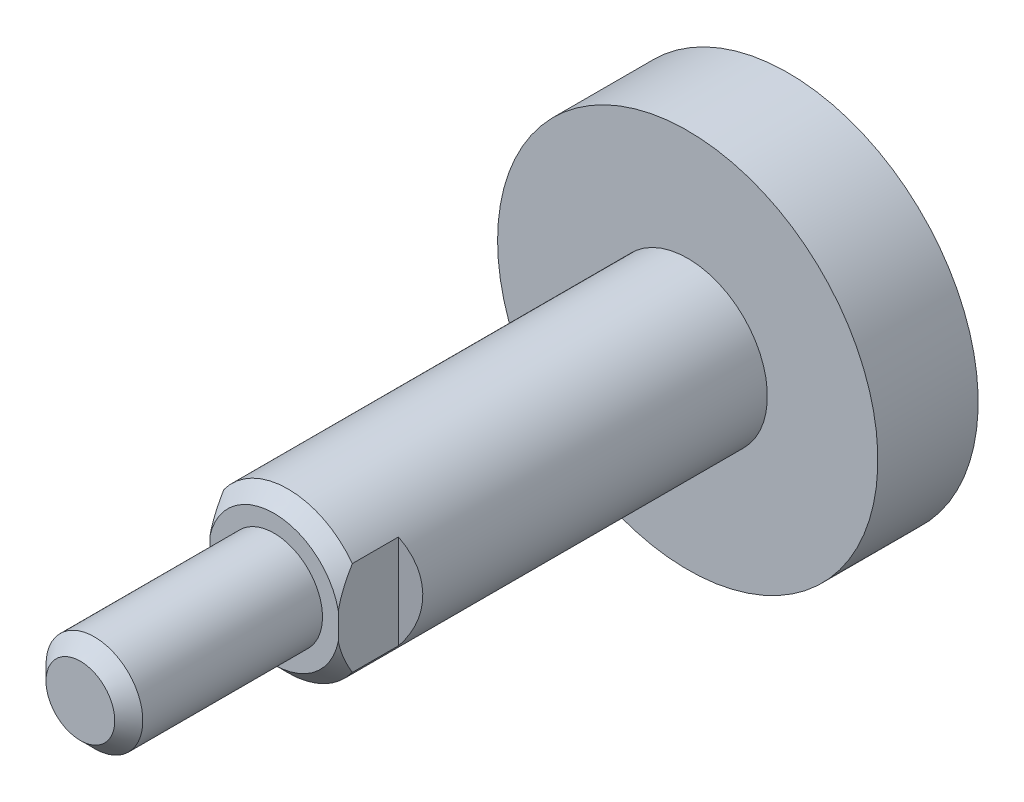
ISO-10303-21;
HEADER;
FILE_DESCRIPTION(('STEP AP214'),'2;1');
FILE_NAME('part.step','',(''),(''),'','','');
FILE_SCHEMA(('AUTOMOTIVE_DESIGN { 1 0 10303 214 1 1 1 1 }'));
ENDSEC;
DATA;
#1=APPLICATION_CONTEXT('core data for automotive mechanical design processes');
#2=APPLICATION_PROTOCOL_DEFINITION('international standard','automotive_design',2000,#1);
#3=PRODUCT_CONTEXT('',#1,'mechanical');
#4=PRODUCT('Part','Part','',(#3));
#5=PRODUCT_RELATED_PRODUCT_CATEGORY('part','',(#4));
#6=PRODUCT_DEFINITION_FORMATION('','',#4);
#7=PRODUCT_DEFINITION_CONTEXT('part definition',#1,'design');
#8=PRODUCT_DEFINITION('design','',#6,#7);
#9=PRODUCT_DEFINITION_SHAPE('','',#8);
#10=(LENGTH_UNIT() NAMED_UNIT(*) SI_UNIT(.MILLI.,.METRE.));
#11=(NAMED_UNIT(*) PLANE_ANGLE_UNIT() SI_UNIT($,.RADIAN.));
#12=(NAMED_UNIT(*) SI_UNIT($,.STERADIAN.) SOLID_ANGLE_UNIT());
#13=UNCERTAINTY_MEASURE_WITH_UNIT(LENGTH_MEASURE(1.E-05),#10,'distance_accuracy_value','');
#14=(GEOMETRIC_REPRESENTATION_CONTEXT(3) GLOBAL_UNCERTAINTY_ASSIGNED_CONTEXT((#13)) GLOBAL_UNIT_ASSIGNED_CONTEXT((#10,
#11,#12)) REPRESENTATION_CONTEXT('',''));
#15=CARTESIAN_POINT('',(0.,0.,0.));
#16=DIRECTION('',(0.,0.,1.));
#17=DIRECTION('',(1.,0.,0.));
#18=AXIS2_PLACEMENT_3D('',#15,#16,#17);
#19=CARTESIAN_POINT('',(0.,0.,35.266));
#20=DIRECTION('',(0.,0.,1.));
#21=DIRECTION('',(1.,0.,0.));
#22=AXIS2_PLACEMENT_3D('',#19,#20,#21);
#23=PLANE('',#22);
#24=CARTESIAN_POINT('',(0.,0.,35.2659999999219));
#25=DIRECTION('',(0.,0.,-1.));
#26=DIRECTION('',(-1.,0.,0.));
#27=AXIS2_PLACEMENT_3D('',#24,#25,#26);
#28=CIRCLE('',#27,1.71299999999519);
#29=CARTESIAN_POINT('',(-1.71299999999519,0.,35.2659999999219));
#30=VERTEX_POINT('',#29);
#31=EDGE_CURVE('E19',#30,#30,#28,.T.);
#32=ORIENTED_EDGE('',*,*,#31,.F.);
#33=EDGE_LOOP('',(#32));
#34=FACE_BOUND('',#33,.T.);
#35=ADVANCED_FACE('F16',(#34),#23,.T.);
#36=CARTESIAN_POINT('',(0.,0.,34.5659999999839));
#37=DIRECTION('',(0.,0.,-1.));
#38=DIRECTION('',(-1.,0.,0.));
#39=AXIS2_PLACEMENT_3D('',#36,#37,#38);
#40=CONICAL_SURFACE('',#39,2.41299999993316,0.785398163397448);
#41=ORIENTED_EDGE('',*,*,#31,.T.);
#42=EDGE_LOOP('',(#41));
#43=FACE_BOUND('',#42,.T.);
#44=CARTESIAN_POINT('',(0.,0.,34.566));
#45=DIRECTION('',(0.,0.,-1.));
#46=DIRECTION('',(-1.,0.,0.));
#47=AXIS2_PLACEMENT_3D('',#44,#45,#46);
#48=CIRCLE('',#47,2.413);
#49=CARTESIAN_POINT('',(-2.413,0.,34.566));
#50=VERTEX_POINT('',#49);
#51=EDGE_CURVE('E71',#50,#50,#48,.T.);
#52=ORIENTED_EDGE('',*,*,#51,.F.);
#53=EDGE_LOOP('',(#52));
#54=FACE_BOUND('',#53,.T.);
#55=ADVANCED_FACE('F196',(#43,#54),#40,.T.);
#56=CARTESIAN_POINT('',(0.,0.,35.266));
#57=DIRECTION('',(0.,0.,-1.));
#58=DIRECTION('',(-1.,0.,0.));
#59=AXIS2_PLACEMENT_3D('',#56,#57,#58);
#60=CYLINDRICAL_SURFACE('',#59,2.413);
#61=ORIENTED_EDGE('',*,*,#51,.T.);
#62=EDGE_LOOP('',(#61));
#63=FACE_BOUND('',#62,.T.);
#64=CARTESIAN_POINT('',(0.,0.,25.614));
#65=DIRECTION('',(0.,0.,-1.));
#66=DIRECTION('',(-1.,0.,0.));
#67=AXIS2_PLACEMENT_3D('',#64,#65,#66);
#68=CIRCLE('',#67,2.413);
#69=CARTESIAN_POINT('',(-2.413,0.,25.614));
#70=VERTEX_POINT('',#69);
#71=EDGE_CURVE('E70',#70,#70,#68,.F.);
#72=ORIENTED_EDGE('',*,*,#71,.T.);
#73=EDGE_LOOP('',(#72));
#74=FACE_BOUND('',#73,.T.);
#75=ADVANCED_FACE('F203',(#63,#74),#60,.T.);
#76=CARTESIAN_POINT('',(0.,0.,25.614));
#77=DIRECTION('',(0.,0.,-1.));
#78=DIRECTION('',(0.,1.,0.));
#79=AXIS2_PLACEMENT_3D('',#76,#77,#78);
#80=PLANE('',#79);
#81=ORIENTED_EDGE('',*,*,#71,.F.);
#82=EDGE_LOOP('',(#81));
#83=FACE_BOUND('',#82,.T.);
#84=DIRECTION('',(0.,1.,0.));
#85=VECTOR('',#84,1.);
#86=CARTESIAN_POINT('',(3.2,0.,25.614));
#87=LINE('',#86,#85);
#88=CARTESIAN_POINT('',(3.2,0.668102537170804,25.6139999999809));
#89=VERTEX_POINT('',#88);
#90=CARTESIAN_POINT('',(3.2,-0.668102537170804,25.6139999999809));
#91=VERTEX_POINT('',#90);
#92=EDGE_CURVE('E58',#89,#91,#87,.F.);
#93=ORIENTED_EDGE('',*,*,#92,.F.);
#94=CARTESIAN_POINT('',(0.,0.,25.6139999999618));
#95=DIRECTION('',(0.,0.,-1.));
#96=DIRECTION('',(0.,1.,0.));
#97=AXIS2_PLACEMENT_3D('',#94,#95,#96);
#98=CIRCLE('',#97,3.26900000004571);
#99=CARTESIAN_POINT('',(-3.2,0.66810253715528,25.6139999999841));
#100=VERTEX_POINT('',#99);
#101=EDGE_CURVE('E91',#100,#89,#98,.T.);
#102=ORIENTED_EDGE('',*,*,#101,.F.);
#103=DIRECTION('',(0.,1.,0.));
#104=VECTOR('',#103,1.);
#105=CARTESIAN_POINT('',(-3.2,-9.475,25.614));
#106=LINE('',#105,#104);
#107=CARTESIAN_POINT('',(-3.2,-0.668102537154749,25.6139999999842));
#108=VERTEX_POINT('',#107);
#109=EDGE_CURVE('E77',#100,#108,#106,.F.);
#110=ORIENTED_EDGE('',*,*,#109,.T.);
#111=CARTESIAN_POINT('',(0.,0.,25.6139999999618));
#112=DIRECTION('',(0.,0.,-1.));
#113=DIRECTION('',(0.,1.,0.));
#114=AXIS2_PLACEMENT_3D('',#111,#112,#113);
#115=CIRCLE('',#114,3.26900000004571);
#116=EDGE_CURVE('E75',#91,#108,#115,.T.);
#117=ORIENTED_EDGE('',*,*,#116,.F.);
#118=EDGE_LOOP('',(#93,#102,#110,#117));
#119=FACE_BOUND('',#118,.T.);
#120=ADVANCED_FACE('F76',(#83,#119),#80,.F.);
#121=CARTESIAN_POINT('',(0.,0.,24.9140000000807));
#122=DIRECTION('',(0.,0.,-1.));
#123=DIRECTION('',(0.,1.,0.));
#124=AXIS2_PLACEMENT_3D('',#121,#122,#123);
#125=CONICAL_SURFACE('',#124,3.96899999998368,0.785398163438051);
#126=CARTESIAN_POINT('',(-3.20000000000324,-0.668102537045593,25.6140000000079));
#127=CARTESIAN_POINT('',(-3.20000000000116,-0.791923989307198,25.5887118948215));
#128=CARTESIAN_POINT('',(-3.20000000000031,-0.914214432197682,25.5569533814339));
#129=CARTESIAN_POINT('',(-3.19999999999969,-1.15522323067476,25.482786734809));
#130=CARTESIAN_POINT('',(-3.19999999999992,-1.27394966585466,25.440405109426));
#131=CARTESIAN_POINT('',(-3.20000000000008,-1.50692397331808,25.3475394481741));
#132=CARTESIAN_POINT('',(-3.20000000000002,-1.62120166838878,25.2971285477279));
#133=CARTESIAN_POINT('',(-3.19999999999998,-1.84665634644185,25.1897204575799));
#134=CARTESIAN_POINT('',(-3.2,-1.95783200288137,25.1327205021669));
#135=CARTESIAN_POINT('',(-3.2,-2.11477722585524,25.0475447828549));
#136=CARTESIAN_POINT('',(-3.2,-2.16170136243503,25.021462011141));
#137=CARTESIAN_POINT('',(-3.2,-2.25515024754837,24.9683835316908));
#138=CARTESIAN_POINT('',(-3.2,-2.30167405357723,24.9413861634868));
#139=CARTESIAN_POINT('',(-3.2,-2.34796954838271,24.9140000000477));
#140=B_SPLINE_CURVE_WITH_KNOTS('',3,(#126,#127,#128,#129,#130,#131,#132,#133,#134,#135,#136,
#137,#138,#139),.UNSPECIFIED.,.F.,.F.,(4,2,2,2,2,2,4),(0.,0.37866331892358,0.756391005243909,
1.13085654278464,1.50547983437229,1.66653163363144,1.82789340191543),.UNSPECIFIED.);
#141=CARTESIAN_POINT('',(-3.2,-2.3479695483686,24.9140000000238));
#142=VERTEX_POINT('',#141);
#143=EDGE_CURVE('E116',#108,#142,#140,.T.);
#144=ORIENTED_EDGE('',*,*,#143,.T.);
#145=CARTESIAN_POINT('',(0.,0.,24.914));
#146=DIRECTION('',(0.,0.,-1.));
#147=DIRECTION('',(-1.,0.,0.));
#148=AXIS2_PLACEMENT_3D('',#145,#146,#147);
#149=CIRCLE('',#148,3.969);
#150=CARTESIAN_POINT('',(3.2,-2.3479695483686,24.9140000000238));
#151=VERTEX_POINT('',#150);
#152=EDGE_CURVE('E85',#151,#142,#149,.T.);
#153=ORIENTED_EDGE('',*,*,#152,.F.);
#154=CARTESIAN_POINT('',(3.2,-2.34796954838271,24.9140000000477));
#155=CARTESIAN_POINT('',(3.2,-2.28227540638902,24.9528576848915));
#156=CARTESIAN_POINT('',(3.2,-2.21612013329714,24.9909397042438));
#157=CARTESIAN_POINT('',(3.2,-2.08277615458881,25.065293160087));
#158=CARTESIAN_POINT('',(3.2,-2.01558715530727,25.1015640691656));
#159=CARTESIAN_POINT('',(3.2,-1.81330543751406,25.2067462963586));
#160=CARTESIAN_POINT('',(3.2,-1.6765834937986,25.2725768397312));
#161=CARTESIAN_POINT('',(3.2,-1.39788707534561,25.3932563066866));
#162=CARTESIAN_POINT('',(3.2,-1.25590184064602,25.4480810761872));
#163=CARTESIAN_POINT('',(3.2,-0.966123687795271,25.5431571719073));
#164=CARTESIAN_POINT('',(3.2,-0.818297789807874,25.5833066541209));
#165=CARTESIAN_POINT('',(3.2,-0.668102537044843,25.6140000000067));
#166=B_SPLINE_CURVE_WITH_KNOTS('',3,(#154,#155,#156,#157,#158,#159,#160,#161,#162,#163,#164,
#165),.UNSPECIFIED.,.F.,.F.,(4,2,2,2,2,4),(0.,0.228972156487962,0.458010607517392,
0.912891486438109,1.36876002116686,1.82773469580555),.UNSPECIFIED.);
#167=EDGE_CURVE('E63',#151,#91,#166,.T.);
#168=ORIENTED_EDGE('',*,*,#167,.T.);
#169=ORIENTED_EDGE('',*,*,#116,.T.);
#170=EDGE_LOOP('',(#144,#153,#168,#169));
#171=FACE_BOUND('',#170,.T.);
#172=ADVANCED_FACE('F84',(#171),#125,.T.);
#173=CARTESIAN_POINT('',(3.2,-9.475,22.614));
#174=DIRECTION('',(-0.500000000000004,0.,-0.866025403784436));
#175=DIRECTION('',(-0.866025403784436,0.,0.500000000000004));
#176=AXIS2_PLACEMENT_3D('',#173,#174,#175);
#177=PLANE('',#176);
#178=CARTESIAN_POINT('',(0.,0.,24.4615208614068));
#179=DIRECTION('',(-0.500000000000004,0.,-0.866025403784436));
#180=DIRECTION('',(0.866025403784436,0.,-0.500000000000004));
#181=AXIS2_PLACEMENT_3D('',#178,#179,#180);
#182=ELLIPSE('',#181,4.58300643682726,3.969);
#183=CARTESIAN_POINT('',(3.2,2.34796954835449,22.614));
#184=VERTEX_POINT('',#183);
#185=CARTESIAN_POINT('',(3.2,-2.34796954835449,22.614));
#186=VERTEX_POINT('',#185);
#187=EDGE_CURVE('E175',#184,#186,#182,.T.);
#188=ORIENTED_EDGE('',*,*,#187,.F.);
#189=DIRECTION('',(0.,1.,0.));
#190=VECTOR('',#189,1.);
#191=CARTESIAN_POINT('',(3.2,-9.475,22.614));
#192=LINE('',#191,#190);
#193=EDGE_CURVE('E86',#184,#186,#192,.F.);
#194=ORIENTED_EDGE('',*,*,#193,.T.);
#195=EDGE_LOOP('',(#188,#194));
#196=FACE_BOUND('',#195,.T.);
#197=ADVANCED_FACE('F111',(#196),#177,.F.);
#198=CARTESIAN_POINT('',(-3.2,-9.475,22.614));
#199=DIRECTION('',(0.500000000000004,0.,-0.866025403784437));
#200=DIRECTION('',(-0.866025403784437,0.,-0.500000000000004));
#201=AXIS2_PLACEMENT_3D('',#198,#199,#200);
#202=PLANE('',#201);
#203=CARTESIAN_POINT('',(0.,0.,24.4615208614068));
#204=DIRECTION('',(0.500000000000004,0.,-0.866025403784437));
#205=DIRECTION('',(-0.866025403784437,0.,-0.500000000000004));
#206=AXIS2_PLACEMENT_3D('',#203,#204,#205);
#207=ELLIPSE('',#206,4.58300643682726,3.969);
#208=CARTESIAN_POINT('',(-3.2,-2.34796954835449,22.614));
#209=VERTEX_POINT('',#208);
#210=CARTESIAN_POINT('',(-3.2,2.34796954835449,22.614));
#211=VERTEX_POINT('',#210);
#212=EDGE_CURVE('E172',#209,#211,#207,.T.);
#213=ORIENTED_EDGE('',*,*,#212,.F.);
#214=DIRECTION('',(0.,1.,0.));
#215=VECTOR('',#214,1.);
#216=CARTESIAN_POINT('',(-3.2,-9.475,22.614));
#217=LINE('',#216,#215);
#218=EDGE_CURVE('E81',#209,#211,#217,.T.);
#219=ORIENTED_EDGE('',*,*,#218,.T.);
#220=EDGE_LOOP('',(#213,#219));
#221=FACE_BOUND('',#220,.T.);
#222=ADVANCED_FACE('F129',(#221),#202,.F.);
#223=CARTESIAN_POINT('',(-3.2,-9.475,25.614));
#224=DIRECTION('',(1.,0.,0.));
#225=DIRECTION('',(0.,0.,-1.));
#226=AXIS2_PLACEMENT_3D('',#223,#224,#225);
#227=PLANE('',#226);
#228=ORIENTED_EDGE('',*,*,#143,.F.);
#229=ORIENTED_EDGE('',*,*,#109,.F.);
#230=CARTESIAN_POINT('',(-3.19999999998987,2.34796954838807,24.9140000000384));
#231=CARTESIAN_POINT('',(-3.19999999999627,2.28227540639574,24.9528576848853));
#232=CARTESIAN_POINT('',(-3.19999999999898,2.21612013330425,24.9909397042391));
#233=CARTESIAN_POINT('',(-3.20000000000102,2.08277615459583,25.0652931600838));
#234=CARTESIAN_POINT('',(-3.20000000000036,2.01558715531381,25.1015640691624));
#235=CARTESIAN_POINT('',(-3.19999999999929,1.81330543751946,25.2067462963555));
#236=CARTESIAN_POINT('',(-3.1999999999998,1.67658349380356,25.2725768397288));
#237=CARTESIAN_POINT('',(-3.2000000000002,1.39788707534957,25.3932563066852));
#238=CARTESIAN_POINT('',(-3.2000000000001,1.25590184064942,25.4480810761861));
#239=CARTESIAN_POINT('',(-3.1999999999999,0.966123687797443,25.5431571719066));
#240=CARTESIAN_POINT('',(-3.19999999999979,0.81829778980937,25.5833066541205));
#241=CARTESIAN_POINT('',(-3.2,0.668102537045719,25.6140000000065));
#242=B_SPLINE_CURVE_WITH_KNOTS('',3,(#230,#231,#232,#233,#234,#235,#236,#237,#238,#239,#240,
#241),.UNSPECIFIED.,.F.,.F.,(4,2,2,2,2,4),(0.,0.22897215648918,0.458010607519761,
0.912891486442591,1.36876002117318,1.82773469581395),.UNSPECIFIED.);
#243=CARTESIAN_POINT('',(-3.2,2.34796954835449,24.9140000000322));
#244=VERTEX_POINT('',#243);
#245=EDGE_CURVE('E121',#244,#100,#242,.T.);
#246=ORIENTED_EDGE('',*,*,#245,.F.);
#247=DIRECTION('',(0.,0.,-1.));
#248=VECTOR('',#247,1.);
#249=CARTESIAN_POINT('',(-3.2,2.34796954835449,36.8400272581176));
#250=LINE('',#249,#248);
#251=EDGE_CURVE('E174',#211,#244,#250,.F.);
#252=ORIENTED_EDGE('',*,*,#251,.F.);
#253=ORIENTED_EDGE('',*,*,#218,.F.);
#254=DIRECTION('',(0.,0.,-1.));
#255=VECTOR('',#254,1.);
#256=CARTESIAN_POINT('',(-3.2,-2.34796954835449,36.8400272581176));
#257=LINE('',#256,#255);
#258=EDGE_CURVE('E177',#142,#209,#257,.T.);
#259=ORIENTED_EDGE('',*,*,#258,.F.);
#260=EDGE_LOOP('',(#228,#229,#246,#252,#253,#259));
#261=FACE_BOUND('',#260,.T.);
#262=ADVANCED_FACE('F125',(#261),#227,.F.);
#263=CARTESIAN_POINT('',(0.,0.,24.9140000000807));
#264=DIRECTION('',(0.,0.,-1.));
#265=DIRECTION('',(0.,1.,0.));
#266=AXIS2_PLACEMENT_3D('',#263,#264,#265);
#267=CONICAL_SURFACE('',#266,3.96899999998368,0.785398163438051);
#268=ORIENTED_EDGE('',*,*,#245,.T.);
#269=ORIENTED_EDGE('',*,*,#101,.T.);
#270=CARTESIAN_POINT('',(3.20000000000325,0.668102537045585,25.6140000000079));
#271=CARTESIAN_POINT('',(3.20000000000117,0.791923989307189,25.5887118948215));
#272=CARTESIAN_POINT('',(3.20000000000031,0.914214432197673,25.5569533814339));
#273=CARTESIAN_POINT('',(3.19999999999969,1.15522323067475,25.482786734809));
#274=CARTESIAN_POINT('',(3.19999999999992,1.27394966585465,25.440405109426));
#275=CARTESIAN_POINT('',(3.20000000000008,1.50692397331807,25.3475394481741));
#276=CARTESIAN_POINT('',(3.20000000000002,1.62120166838877,25.2971285477279));
#277=CARTESIAN_POINT('',(3.19999999999998,1.84665634644184,25.1897204575799));
#278=CARTESIAN_POINT('',(3.2,1.95783200288136,25.1327205021669));
#279=CARTESIAN_POINT('',(3.2,2.11477722585523,25.0475447828549));
#280=CARTESIAN_POINT('',(3.2,2.16170136243502,25.021462011141));
#281=CARTESIAN_POINT('',(3.2,2.25515024754836,24.9683835316908));
#282=CARTESIAN_POINT('',(3.2,2.30167405357723,24.9413861634868));
#283=CARTESIAN_POINT('',(3.2,2.34796954838271,24.9140000000477));
#284=B_SPLINE_CURVE_WITH_KNOTS('',3,(#270,#271,#272,#273,#274,#275,#276,#277,#278,#279,#280,
#281,#282,#283),.UNSPECIFIED.,.F.,.F.,(4,2,2,2,2,2,4),(0.,0.378663318923578,0.756391005243905,
1.13085654278464,1.50547983437229,1.66653163363144,1.82789340191544),.UNSPECIFIED.);
#285=CARTESIAN_POINT('',(3.2,2.3479695483686,24.9140000000238));
#286=VERTEX_POINT('',#285);
#287=EDGE_CURVE('E66',#89,#286,#284,.T.);
#288=ORIENTED_EDGE('',*,*,#287,.T.);
#289=CARTESIAN_POINT('',(0.,0.,24.914));
#290=DIRECTION('',(0.,0.,-1.));
#291=DIRECTION('',(-1.,0.,0.));
#292=AXIS2_PLACEMENT_3D('',#289,#290,#291);
#293=CIRCLE('',#292,3.969);
#294=EDGE_CURVE('E34',#244,#286,#293,.T.);
#295=ORIENTED_EDGE('',*,*,#294,.F.);
#296=EDGE_LOOP('',(#268,#269,#288,#295));
#297=FACE_BOUND('',#296,.T.);
#298=ADVANCED_FACE('F128',(#297),#267,.T.);
#299=CARTESIAN_POINT('',(3.2,-9.475,25.614));
#300=DIRECTION('',(-1.,0.,0.));
#301=DIRECTION('',(0.,0.,1.));
#302=AXIS2_PLACEMENT_3D('',#299,#300,#301);
#303=PLANE('',#302);
#304=ORIENTED_EDGE('',*,*,#287,.F.);
#305=ORIENTED_EDGE('',*,*,#92,.T.);
#306=ORIENTED_EDGE('',*,*,#167,.F.);
#307=DIRECTION('',(0.,0.,-1.));
#308=VECTOR('',#307,1.);
#309=CARTESIAN_POINT('',(3.2,-2.34796954835449,36.8400272581176));
#310=LINE('',#309,#308);
#311=EDGE_CURVE('E88',#186,#151,#310,.F.);
#312=ORIENTED_EDGE('',*,*,#311,.F.);
#313=ORIENTED_EDGE('',*,*,#193,.F.);
#314=DIRECTION('',(0.,0.,-1.));
#315=VECTOR('',#314,1.);
#316=CARTESIAN_POINT('',(3.2,2.34796954835449,36.8400272581176));
#317=LINE('',#316,#315);
#318=EDGE_CURVE('E166',#286,#184,#317,.T.);
#319=ORIENTED_EDGE('',*,*,#318,.F.);
#320=EDGE_LOOP('',(#304,#305,#306,#312,#313,#319));
#321=FACE_BOUND('',#320,.T.);
#322=ADVANCED_FACE('F60',(#321),#303,.F.);
#323=CARTESIAN_POINT('',(0.,0.,36.8400272581176));
#324=DIRECTION('',(0.,0.,-1.));
#325=DIRECTION('',(-1.,0.,0.));
#326=AXIS2_PLACEMENT_3D('',#323,#324,#325);
#327=CYLINDRICAL_SURFACE('',#326,3.969);
#328=CARTESIAN_POINT('',(0.,0.,5.));
#329=DIRECTION('',(0.,0.,-1.));
#330=DIRECTION('',(-1.,0.,0.));
#331=AXIS2_PLACEMENT_3D('',#328,#329,#330);
#332=CIRCLE('',#331,3.969);
#333=CARTESIAN_POINT('',(-3.969,0.,5.));
#334=VERTEX_POINT('',#333);
#335=EDGE_CURVE('E164',#334,#334,#332,.T.);
#336=ORIENTED_EDGE('',*,*,#335,.F.);
#337=EDGE_LOOP('',(#336));
#338=FACE_BOUND('',#337,.T.);
#339=ORIENTED_EDGE('',*,*,#294,.T.);
#340=ORIENTED_EDGE('',*,*,#318,.T.);
#341=ORIENTED_EDGE('',*,*,#187,.T.);
#342=ORIENTED_EDGE('',*,*,#311,.T.);
#343=ORIENTED_EDGE('',*,*,#152,.T.);
#344=ORIENTED_EDGE('',*,*,#258,.T.);
#345=ORIENTED_EDGE('',*,*,#212,.T.);
#346=ORIENTED_EDGE('',*,*,#251,.T.);
#347=EDGE_LOOP('',(#339,#340,#341,#342,#343,#344,#345,#346));
#348=FACE_BOUND('',#347,.T.);
#349=ADVANCED_FACE('F155',(#338,#348),#327,.T.);
#350=CARTESIAN_POINT('',(0.,0.,5.));
#351=DIRECTION('',(0.,0.,1.));
#352=DIRECTION('',(1.,0.,0.));
#353=AXIS2_PLACEMENT_3D('',#350,#351,#352);
#354=PLANE('',#353);
#355=CARTESIAN_POINT('',(0.,0.,5.));
#356=DIRECTION('',(0.,0.,-1.));
#357=DIRECTION('',(-1.,0.,0.));
#358=AXIS2_PLACEMENT_3D('',#355,#356,#357);
#359=CIRCLE('',#358,9.475);
#360=CARTESIAN_POINT('',(-9.475,0.,5.));
#361=VERTEX_POINT('',#360);
#362=EDGE_CURVE('E25',#361,#361,#359,.T.);
#363=ORIENTED_EDGE('',*,*,#362,.F.);
#364=EDGE_LOOP('',(#363));
#365=FACE_BOUND('',#364,.T.);
#366=ORIENTED_EDGE('',*,*,#335,.T.);
#367=EDGE_LOOP('',(#366));
#368=FACE_BOUND('',#367,.T.);
#369=ADVANCED_FACE('F149',(#365,#368),#354,.T.);
#370=CARTESIAN_POINT('',(0.,0.,5.));
#371=DIRECTION('',(0.,0.,-1.));
#372=DIRECTION('',(-1.,0.,0.));
#373=AXIS2_PLACEMENT_3D('',#370,#371,#372);
#374=CYLINDRICAL_SURFACE('',#373,9.475);
#375=ORIENTED_EDGE('',*,*,#362,.T.);
#376=EDGE_LOOP('',(#375));
#377=FACE_BOUND('',#376,.T.);
#378=CARTESIAN_POINT('',(0.,0.,0.));
#379=DIRECTION('',(0.,0.,-1.));
#380=DIRECTION('',(-1.,0.,0.));
#381=AXIS2_PLACEMENT_3D('',#378,#379,#380);
#382=CIRCLE('',#381,9.475);
#383=CARTESIAN_POINT('',(-9.475,0.,0.));
#384=VERTEX_POINT('',#383);
#385=EDGE_CURVE('E11',#384,#384,#382,.F.);
#386=ORIENTED_EDGE('',*,*,#385,.T.);
#387=EDGE_LOOP('',(#386));
#388=FACE_BOUND('',#387,.T.);
#389=ADVANCED_FACE('F143',(#377,#388),#374,.T.);
#390=CARTESIAN_POINT('',(0.,0.,0.));
#391=DIRECTION('',(0.,0.,1.));
#392=DIRECTION('',(1.,0.,0.));
#393=AXIS2_PLACEMENT_3D('',#390,#391,#392);
#394=PLANE('',#393);
#395=ORIENTED_EDGE('',*,*,#385,.F.);
#396=EDGE_LOOP('',(#395));
#397=FACE_BOUND('',#396,.T.);
#398=ADVANCED_FACE('F141',(#397),#394,.F.);
#399=CLOSED_SHELL('',(#35,#55,#75,#120,#172,#197,#222,#262,#298,#322,#349,#369,#389,#398));
#400=MANIFOLD_SOLID_BREP('B1',#399);
#401=ADVANCED_BREP_SHAPE_REPRESENTATION('',(#18,#400),#14);
#402=SHAPE_DEFINITION_REPRESENTATION(#9,#401);
ENDSEC;
END-ISO-10303-21;
